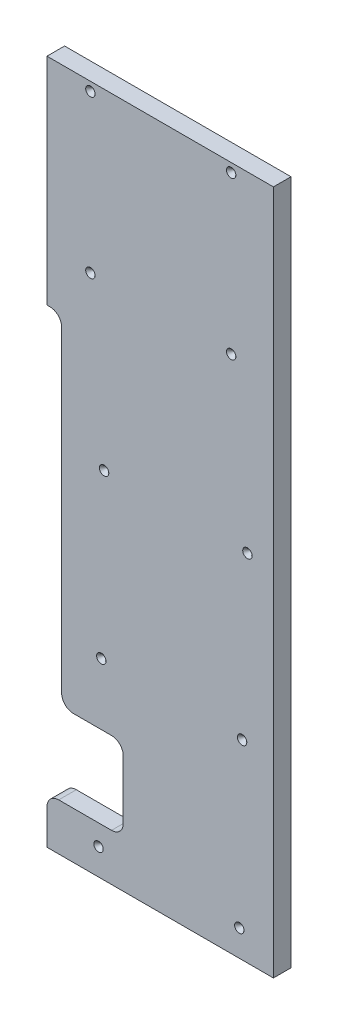
ISO-10303-21;
HEADER;
FILE_DESCRIPTION(('STEP AP214'),'2;1');
FILE_NAME('part.step','',(''),(''),'','','');
FILE_SCHEMA(('AUTOMOTIVE_DESIGN { 1 0 10303 214 1 1 1 1 }'));
ENDSEC;
DATA;
#1=APPLICATION_CONTEXT('core data for automotive mechanical design processes');
#2=APPLICATION_PROTOCOL_DEFINITION('international standard','automotive_design',2000,#1);
#3=PRODUCT_CONTEXT('',#1,'mechanical');
#4=PRODUCT('Part','Part','',(#3));
#5=PRODUCT_RELATED_PRODUCT_CATEGORY('part','',(#4));
#6=PRODUCT_DEFINITION_FORMATION('','',#4);
#7=PRODUCT_DEFINITION_CONTEXT('part definition',#1,'design');
#8=PRODUCT_DEFINITION('design','',#6,#7);
#9=PRODUCT_DEFINITION_SHAPE('','',#8);
#10=(LENGTH_UNIT() NAMED_UNIT(*) SI_UNIT(.MILLI.,.METRE.));
#11=(NAMED_UNIT(*) PLANE_ANGLE_UNIT() SI_UNIT($,.RADIAN.));
#12=(NAMED_UNIT(*) SI_UNIT($,.STERADIAN.) SOLID_ANGLE_UNIT());
#13=UNCERTAINTY_MEASURE_WITH_UNIT(LENGTH_MEASURE(1.E-05),#10,'distance_accuracy_value','');
#14=(GEOMETRIC_REPRESENTATION_CONTEXT(3) GLOBAL_UNCERTAINTY_ASSIGNED_CONTEXT((#13)) GLOBAL_UNIT_ASSIGNED_CONTEXT((#10,
#11,#12)) REPRESENTATION_CONTEXT('',''));
#15=CARTESIAN_POINT('',(0.,0.,0.));
#16=DIRECTION('',(0.,0.,1.));
#17=DIRECTION('',(1.,0.,0.));
#18=AXIS2_PLACEMENT_3D('',#15,#16,#17);
#19=CARTESIAN_POINT('',(80.0100000000102,0.,2.90878432451835E-13));
#20=DIRECTION('',(-1.,0.,0.));
#21=DIRECTION('',(0.,0.,1.));
#22=AXIS2_PLACEMENT_3D('',#19,#20,#21);
#23=PLANE('',#22);
#24=DIRECTION('',(0.,-1.,0.));
#25=VECTOR('',#24,1.);
#26=CARTESIAN_POINT('',(80.0099999999995,5935.9800001442,2740.66));
#27=LINE('',#26,#25);
#28=CARTESIAN_POINT('',(80.0099999999995,5935.9800001442,2740.66));
#29=VERTEX_POINT('',#28);
#30=CARTESIAN_POINT('',(80.0099999999994,5702.6175001442,2740.66));
#31=VERTEX_POINT('',#30);
#32=EDGE_CURVE('E162',#29,#31,#27,.T.);
#33=ORIENTED_EDGE('',*,*,#32,.T.);
#34=DIRECTION('',(0.,0.,1.));
#35=VECTOR('',#34,1.);
#36=CARTESIAN_POINT('',(80.0099999999994,5702.6175001442,2740.659));
#37=LINE('',#36,#35);
#38=CARTESIAN_POINT('',(80.0099999999994,5702.6175001442,2759.71));
#39=VERTEX_POINT('',#38);
#40=EDGE_CURVE('E143',#31,#39,#37,.T.);
#41=ORIENTED_EDGE('',*,*,#40,.T.);
#42=DIRECTION('',(0.,1.,0.));
#43=VECTOR('',#42,1.);
#44=CARTESIAN_POINT('',(80.0099999999995,5194.3,2759.71));
#45=LINE('',#44,#43);
#46=CARTESIAN_POINT('',(80.0099999999994,5935.9800001442,2759.71));
#47=VERTEX_POINT('',#46);
#48=EDGE_CURVE('E175',#39,#47,#45,.T.);
#49=ORIENTED_EDGE('',*,*,#48,.T.);
#50=DIRECTION('',(0.,0.,-1.));
#51=VECTOR('',#50,1.);
#52=CARTESIAN_POINT('',(80.0099999999994,5935.9800001442,2759.71));
#53=LINE('',#52,#51);
#54=EDGE_CURVE('E170',#47,#29,#53,.T.);
#55=ORIENTED_EDGE('',*,*,#54,.T.);
#56=EDGE_LOOP('',(#33,#41,#49,#55));
#57=FACE_BOUND('',#56,.T.);
#58=ADVANCED_FACE('F34',(#57),#23,.T.);
#59=CARTESIAN_POINT('',(205.74,5565.14000007211,2759.71));
#60=DIRECTION('',(0.,0.,-1.));
#61=DIRECTION('',(-1.,0.,0.));
#62=AXIS2_PLACEMENT_3D('',#59,#60,#61);
#63=PLANE('',#62);
#64=CARTESIAN_POINT('',(127.000000000001,5926.4550001442,2759.71000000001));
#65=DIRECTION('',(0.,0.,1.));
#66=DIRECTION('',(1.,0.,0.));
#67=AXIS2_PLACEMENT_3D('',#64,#65,#66);
#68=CIRCLE('',#67,5.08);
#69=CARTESIAN_POINT('',(132.080000000001,5926.4550001442,2759.71000000001));
#70=VERTEX_POINT('',#69);
#71=EDGE_CURVE('E167',#70,#70,#68,.T.);
#72=ORIENTED_EDGE('',*,*,#71,.F.);
#73=EDGE_LOOP('',(#72));
#74=FACE_BOUND('',#73,.T.);
#75=CARTESIAN_POINT('',(279.400000000001,5926.4550001442,2759.71000000001));
#76=DIRECTION('',(0.,0.,1.));
#77=DIRECTION('',(1.,0.,0.));
#78=AXIS2_PLACEMENT_3D('',#75,#76,#77);
#79=CIRCLE('',#78,5.07999999999997);
#80=CARTESIAN_POINT('',(284.480000000001,5926.4550001442,2759.71000000001));
#81=VERTEX_POINT('',#80);
#82=EDGE_CURVE('E252',#81,#81,#79,.T.);
#83=ORIENTED_EDGE('',*,*,#82,.F.);
#84=EDGE_LOOP('',(#83));
#85=FACE_BOUND('',#84,.T.);
#86=CARTESIAN_POINT('',(127.000000000001,5756.275,2759.71000000001));
#87=DIRECTION('',(0.,0.,1.));
#88=DIRECTION('',(1.,0.,0.));
#89=AXIS2_PLACEMENT_3D('',#86,#87,#88);
#90=CIRCLE('',#89,5.08);
#91=CARTESIAN_POINT('',(132.080000000001,5756.275,2759.71000000001));
#92=VERTEX_POINT('',#91);
#93=EDGE_CURVE('E247',#92,#92,#90,.T.);
#94=ORIENTED_EDGE('',*,*,#93,.F.);
#95=EDGE_LOOP('',(#94));
#96=FACE_BOUND('',#95,.T.);
#97=CARTESIAN_POINT('',(279.400000000001,5756.275,2759.71000000001));
#98=DIRECTION('',(0.,0.,1.));
#99=DIRECTION('',(1.,0.,0.));
#100=AXIS2_PLACEMENT_3D('',#97,#98,#99);
#101=CIRCLE('',#100,5.07999999999997);
#102=CARTESIAN_POINT('',(284.480000000001,5756.275,2759.71000000001));
#103=VERTEX_POINT('',#102);
#104=EDGE_CURVE('E242',#103,#103,#101,.T.);
#105=ORIENTED_EDGE('',*,*,#104,.F.);
#106=EDGE_LOOP('',(#105));
#107=FACE_BOUND('',#106,.T.);
#108=CARTESIAN_POINT('',(141.857783583226,5578.47500000002,2759.71000000001));
#109=DIRECTION('',(0.,0.,1.));
#110=DIRECTION('',(1.,0.,0.));
#111=AXIS2_PLACEMENT_3D('',#108,#109,#110);
#112=CIRCLE('',#111,5.08);
#113=CARTESIAN_POINT('',(146.937783583226,5578.47500000002,2759.71000000001));
#114=VERTEX_POINT('',#113);
#115=EDGE_CURVE('E237',#114,#114,#112,.T.);
#116=ORIENTED_EDGE('',*,*,#115,.F.);
#117=EDGE_LOOP('',(#116));
#118=FACE_BOUND('',#117,.T.);
#119=CARTESIAN_POINT('',(296.988891791613,5578.47500000002,2759.71000000001));
#120=DIRECTION('',(0.,0.,1.));
#121=DIRECTION('',(1.,0.,0.));
#122=AXIS2_PLACEMENT_3D('',#119,#120,#121);
#123=CIRCLE('',#122,5.07999999999997);
#124=CARTESIAN_POINT('',(302.068891791613,5578.47500000002,2759.71000000001));
#125=VERTEX_POINT('',#124);
#126=EDGE_CURVE('E232',#125,#125,#123,.T.);
#127=ORIENTED_EDGE('',*,*,#126,.F.);
#128=EDGE_LOOP('',(#127));
#129=FACE_BOUND('',#128,.T.);
#130=CARTESIAN_POINT('',(138.830271302983,5400.675,2759.71000000001));
#131=DIRECTION('',(0.,0.,1.));
#132=DIRECTION('',(1.,0.,0.));
#133=AXIS2_PLACEMENT_3D('',#130,#131,#132);
#134=CIRCLE('',#133,5.08);
#135=CARTESIAN_POINT('',(143.910271302983,5400.675,2759.71000000001));
#136=VERTEX_POINT('',#135);
#137=EDGE_CURVE('E227',#136,#136,#134,.T.);
#138=ORIENTED_EDGE('',*,*,#137,.F.);
#139=EDGE_LOOP('',(#138));
#140=FACE_BOUND('',#139,.T.);
#141=CARTESIAN_POINT('',(291.230271302983,5400.675,2759.71000000001));
#142=DIRECTION('',(0.,0.,1.));
#143=DIRECTION('',(1.,0.,0.));
#144=AXIS2_PLACEMENT_3D('',#141,#142,#143);
#145=CIRCLE('',#144,5.07999999999997);
#146=CARTESIAN_POINT('',(296.310271302983,5400.675,2759.71000000001));
#147=VERTEX_POINT('',#146);
#148=EDGE_CURVE('E222',#147,#147,#145,.T.);
#149=ORIENTED_EDGE('',*,*,#148,.F.);
#150=EDGE_LOOP('',(#149));
#151=FACE_BOUND('',#150,.T.);
#152=CARTESIAN_POINT('',(135.802759022741,5222.875,2759.71000000001));
#153=DIRECTION('',(0.,0.,1.));
#154=DIRECTION('',(1.,0.,0.));
#155=AXIS2_PLACEMENT_3D('',#152,#153,#154);
#156=CIRCLE('',#155,5.08);
#157=CARTESIAN_POINT('',(140.882759022741,5222.875,2759.71000000001));
#158=VERTEX_POINT('',#157);
#159=EDGE_CURVE('E217',#158,#158,#156,.T.);
#160=ORIENTED_EDGE('',*,*,#159,.F.);
#161=EDGE_LOOP('',(#160));
#162=FACE_BOUND('',#161,.T.);
#163=CARTESIAN_POINT('',(288.202759022741,5222.875,2759.71000000001));
#164=DIRECTION('',(0.,0.,1.));
#165=DIRECTION('',(1.,0.,0.));
#166=AXIS2_PLACEMENT_3D('',#163,#164,#165);
#167=CIRCLE('',#166,5.07999999999997);
#168=CARTESIAN_POINT('',(293.282759022741,5222.875,2759.71000000001));
#169=VERTEX_POINT('',#168);
#170=EDGE_CURVE('E212',#169,#169,#167,.T.);
#171=ORIENTED_EDGE('',*,*,#170,.F.);
#172=EDGE_LOOP('',(#171));
#173=FACE_BOUND('',#172,.T.);
#174=DIRECTION('',(0.,-1.,0.));
#175=VECTOR('',#174,1.);
#176=CARTESIAN_POINT('',(95.885,0.,2759.71000000001));
#177=LINE('',#176,#175);
#178=CARTESIAN_POINT('',(95.8849999999995,5689.9175001442,2759.71000000001));
#179=VERTEX_POINT('',#178);
#180=CARTESIAN_POINT('',(95.8849999999995,5346.7,2759.71000000001));
#181=VERTEX_POINT('',#180);
#182=EDGE_CURVE('E314',#179,#181,#177,.T.);
#183=ORIENTED_EDGE('',*,*,#182,.T.);
#184=CARTESIAN_POINT('',(108.585,5346.7,2759.71));
#185=DIRECTION('',(0.,0.,-1.));
#186=DIRECTION('',(-1.,0.,0.));
#187=AXIS2_PLACEMENT_3D('',#184,#185,#186);
#188=CIRCLE('',#187,12.7);
#189=CARTESIAN_POINT('',(108.585,5334.,2759.71000000001));
#190=VERTEX_POINT('',#189);
#191=EDGE_CURVE('E262',#181,#190,#188,.F.);
#192=ORIENTED_EDGE('',*,*,#191,.T.);
#193=DIRECTION('',(1.,0.,0.));
#194=VECTOR('',#193,1.);
#195=CARTESIAN_POINT('',(0.,5334.,2759.71000000001));
#196=LINE('',#195,#194);
#197=CARTESIAN_POINT('',(149.86,5334.,2759.71000000001));
#198=VERTEX_POINT('',#197);
#199=EDGE_CURVE('E154',#190,#198,#196,.T.);
#200=ORIENTED_EDGE('',*,*,#199,.T.);
#201=CARTESIAN_POINT('',(149.86,5321.3,2759.71));
#202=DIRECTION('',(0.,0.,-1.));
#203=DIRECTION('',(-1.,0.,0.));
#204=AXIS2_PLACEMENT_3D('',#201,#202,#203);
#205=CIRCLE('',#204,12.7);
#206=CARTESIAN_POINT('',(162.56,5321.3,2759.71000000001));
#207=VERTEX_POINT('',#206);
#208=EDGE_CURVE('E286',#198,#207,#205,.T.);
#209=ORIENTED_EDGE('',*,*,#208,.T.);
#210=DIRECTION('',(0.,1.,0.));
#211=VECTOR('',#210,1.);
#212=CARTESIAN_POINT('',(162.56,0.,2759.71000000001));
#213=LINE('',#212,#211);
#214=CARTESIAN_POINT('',(162.56,5257.8,2759.71000000001));
#215=VERTEX_POINT('',#214);
#216=EDGE_CURVE('E296',#215,#207,#213,.T.);
#217=ORIENTED_EDGE('',*,*,#216,.F.);
#218=CARTESIAN_POINT('',(149.86,5257.8,2759.71));
#219=DIRECTION('',(0.,0.,-1.));
#220=DIRECTION('',(-1.,0.,0.));
#221=AXIS2_PLACEMENT_3D('',#218,#219,#220);
#222=CIRCLE('',#221,12.7);
#223=CARTESIAN_POINT('',(149.86,5245.1,2759.71000000001));
#224=VERTEX_POINT('',#223);
#225=EDGE_CURVE('E42',#215,#224,#222,.T.);
#226=ORIENTED_EDGE('',*,*,#225,.T.);
#227=DIRECTION('',(1.,0.,0.));
#228=VECTOR('',#227,1.);
#229=CARTESIAN_POINT('',(0.,5245.1,2759.71000000001));
#230=LINE('',#229,#228);
#231=CARTESIAN_POINT('',(92.7099999999995,5245.1,2759.71000000001));
#232=VERTEX_POINT('',#231);
#233=EDGE_CURVE('E295',#232,#224,#230,.T.);
#234=ORIENTED_EDGE('',*,*,#233,.F.);
#235=CARTESIAN_POINT('',(92.7099999999995,5232.4,2759.71));
#236=DIRECTION('',(0.,0.,-1.));
#237=DIRECTION('',(-1.,0.,0.));
#238=AXIS2_PLACEMENT_3D('',#235,#236,#237);
#239=CIRCLE('',#238,12.7);
#240=CARTESIAN_POINT('',(80.0099999999995,5232.4,2759.71));
#241=VERTEX_POINT('',#240);
#242=EDGE_CURVE('E260',#232,#241,#239,.F.);
#243=ORIENTED_EDGE('',*,*,#242,.T.);
#244=CARTESIAN_POINT('',(80.0099999999995,5194.3,2759.71));
#245=VERTEX_POINT('',#244);
#246=EDGE_CURVE('E180',#245,#241,#45,.T.);
#247=ORIENTED_EDGE('',*,*,#246,.F.);
#248=DIRECTION('',(1.,0.,0.));
#249=VECTOR('',#248,1.);
#250=CARTESIAN_POINT('',(325.12,5194.3,2759.71));
#251=LINE('',#250,#249);
#252=CARTESIAN_POINT('',(325.12,5194.3,2759.71));
#253=VERTEX_POINT('',#252);
#254=EDGE_CURVE('E201',#253,#245,#251,.F.);
#255=ORIENTED_EDGE('',*,*,#254,.F.);
#256=DIRECTION('',(0.,1.,0.));
#257=VECTOR('',#256,1.);
#258=CARTESIAN_POINT('',(325.12,5935.9800001442,2759.71));
#259=LINE('',#258,#257);
#260=CARTESIAN_POINT('',(325.12,5935.9800001442,2759.71));
#261=VERTEX_POINT('',#260);
#262=EDGE_CURVE('E182',#261,#253,#259,.F.);
#263=ORIENTED_EDGE('',*,*,#262,.F.);
#264=DIRECTION('',(1.,0.,0.));
#265=VECTOR('',#264,1.);
#266=CARTESIAN_POINT('',(86.3599999999992,5935.9800001442,2759.71));
#267=LINE('',#266,#265);
#268=EDGE_CURVE('E195',#47,#261,#267,.T.);
#269=ORIENTED_EDGE('',*,*,#268,.F.);
#270=ORIENTED_EDGE('',*,*,#48,.F.);
#271=DIRECTION('',(1.,0.,0.));
#272=VECTOR('',#271,1.);
#273=CARTESIAN_POINT('',(0.,5702.6175001442,2759.71000000001));
#274=LINE('',#273,#272);
#275=CARTESIAN_POINT('',(83.1849999999995,5702.6175001442,2759.71000000001));
#276=VERTEX_POINT('',#275);
#277=EDGE_CURVE('E150',#39,#276,#274,.T.);
#278=ORIENTED_EDGE('',*,*,#277,.T.);
#279=CARTESIAN_POINT('',(83.1849999999995,5689.9175001442,2759.71));
#280=DIRECTION('',(0.,0.,-1.));
#281=DIRECTION('',(-1.,0.,0.));
#282=AXIS2_PLACEMENT_3D('',#279,#280,#281);
#283=CIRCLE('',#282,12.7);
#284=EDGE_CURVE('E283',#276,#179,#283,.T.);
#285=ORIENTED_EDGE('',*,*,#284,.T.);
#286=EDGE_LOOP('',(#183,#192,#200,#209,#217,#226,#234,#243,#247,#255,#263,#269,#270,#278,#285));
#287=FACE_BOUND('',#286,.T.);
#288=ADVANCED_FACE('F294',(#74,#85,#96,#107,#118,#129,#140,#151,#162,#173,#287),#63,.F.);
#289=CARTESIAN_POINT('',(325.12,5935.9800001442,2759.71));
#290=DIRECTION('',(1.,0.,0.));
#291=DIRECTION('',(0.,0.,-1.));
#292=AXIS2_PLACEMENT_3D('',#289,#290,#291);
#293=PLANE('',#292);
#294=DIRECTION('',(0.,1.,0.));
#295=VECTOR('',#294,1.);
#296=CARTESIAN_POINT('',(325.12,5565.14000007211,2740.66));
#297=LINE('',#296,#295);
#298=CARTESIAN_POINT('',(325.12,5935.9800001442,2740.66));
#299=VERTEX_POINT('',#298);
#300=CARTESIAN_POINT('',(325.12,5194.3,2740.66));
#301=VERTEX_POINT('',#300);
#302=EDGE_CURVE('E189',#299,#301,#297,.F.);
#303=ORIENTED_EDGE('',*,*,#302,.F.);
#304=DIRECTION('',(0.,0.,1.));
#305=VECTOR('',#304,1.);
#306=CARTESIAN_POINT('',(325.12,5935.9800001442,2759.71));
#307=LINE('',#306,#305);
#308=EDGE_CURVE('E192',#261,#299,#307,.F.);
#309=ORIENTED_EDGE('',*,*,#308,.F.);
#310=ORIENTED_EDGE('',*,*,#262,.T.);
#311=DIRECTION('',(0.,0.,1.));
#312=VECTOR('',#311,1.);
#313=CARTESIAN_POINT('',(325.12,5194.3,2759.71));
#314=LINE('',#313,#312);
#315=EDGE_CURVE('E198',#301,#253,#314,.T.);
#316=ORIENTED_EDGE('',*,*,#315,.F.);
#317=EDGE_LOOP('',(#303,#309,#310,#316));
#318=FACE_BOUND('',#317,.T.);
#319=ADVANCED_FACE('F376',(#318),#293,.T.);
#320=CARTESIAN_POINT('',(325.12,5194.3,2759.71));
#321=DIRECTION('',(0.,-1.,0.));
#322=DIRECTION('',(1.,0.,0.));
#323=AXIS2_PLACEMENT_3D('',#320,#321,#322);
#324=PLANE('',#323);
#325=DIRECTION('',(-1.,0.,0.));
#326=VECTOR('',#325,1.);
#327=CARTESIAN_POINT('',(205.74,5194.3,2740.66));
#328=LINE('',#327,#326);
#329=CARTESIAN_POINT('',(80.0099999999996,5194.3,2740.66));
#330=VERTEX_POINT('',#329);
#331=EDGE_CURVE('E186',#301,#330,#328,.T.);
#332=ORIENTED_EDGE('',*,*,#331,.F.);
#333=ORIENTED_EDGE('',*,*,#315,.T.);
#334=ORIENTED_EDGE('',*,*,#254,.T.);
#335=DIRECTION('',(0.,0.,1.));
#336=VECTOR('',#335,1.);
#337=CARTESIAN_POINT('',(80.0099999999996,5194.3,2740.66));
#338=LINE('',#337,#336);
#339=EDGE_CURVE('E171',#330,#245,#338,.T.);
#340=ORIENTED_EDGE('',*,*,#339,.F.);
#341=EDGE_LOOP('',(#332,#333,#334,#340));
#342=FACE_BOUND('',#341,.T.);
#343=ADVANCED_FACE('F385',(#342),#324,.T.);
#344=CARTESIAN_POINT('',(86.3599999999992,5935.9800001442,2759.71));
#345=DIRECTION('',(0.,1.,0.));
#346=DIRECTION('',(0.,0.,1.));
#347=AXIS2_PLACEMENT_3D('',#344,#345,#346);
#348=PLANE('',#347);
#349=DIRECTION('',(-1.,0.,0.));
#350=VECTOR('',#349,1.);
#351=CARTESIAN_POINT('',(205.74,5935.9800001442,2740.66));
#352=LINE('',#351,#350);
#353=EDGE_CURVE('E183',#29,#299,#352,.F.);
#354=ORIENTED_EDGE('',*,*,#353,.F.);
#355=ORIENTED_EDGE('',*,*,#54,.F.);
#356=ORIENTED_EDGE('',*,*,#268,.T.);
#357=ORIENTED_EDGE('',*,*,#308,.T.);
#358=EDGE_LOOP('',(#354,#355,#356,#357));
#359=FACE_BOUND('',#358,.T.);
#360=ADVANCED_FACE('F399',(#359),#348,.T.);
#361=CARTESIAN_POINT('',(205.74,5565.14000007211,2740.66));
#362=DIRECTION('',(0.,0.,-1.));
#363=DIRECTION('',(-1.,0.,0.));
#364=AXIS2_PLACEMENT_3D('',#361,#362,#363);
#365=PLANE('',#364);
#366=DIRECTION('',(1.,0.,0.));
#367=VECTOR('',#366,1.);
#368=CARTESIAN_POINT('',(0.,5334.,2740.66));
#369=LINE('',#368,#367);
#370=CARTESIAN_POINT('',(108.585,5334.,2740.66));
#371=VERTEX_POINT('',#370);
#372=CARTESIAN_POINT('',(149.86,5334.,2740.66));
#373=VERTEX_POINT('',#372);
#374=EDGE_CURVE('E312',#371,#373,#369,.T.);
#375=ORIENTED_EDGE('',*,*,#374,.F.);
#376=CARTESIAN_POINT('',(108.585,5346.7,2740.66));
#377=DIRECTION('',(0.,0.,-1.));
#378=DIRECTION('',(-1.,0.,0.));
#379=AXIS2_PLACEMENT_3D('',#376,#377,#378);
#380=CIRCLE('',#379,12.7);
#381=CARTESIAN_POINT('',(95.8849999999995,5346.7,2740.66));
#382=VERTEX_POINT('',#381);
#383=EDGE_CURVE('E271',#371,#382,#380,.T.);
#384=ORIENTED_EDGE('',*,*,#383,.T.);
#385=DIRECTION('',(0.,-1.,0.));
#386=VECTOR('',#385,1.);
#387=CARTESIAN_POINT('',(95.885,0.,2740.66));
#388=LINE('',#387,#386);
#389=CARTESIAN_POINT('',(95.8849999999995,5689.9175001442,2740.66));
#390=VERTEX_POINT('',#389);
#391=EDGE_CURVE('E317',#390,#382,#388,.T.);
#392=ORIENTED_EDGE('',*,*,#391,.F.);
#393=CARTESIAN_POINT('',(83.1849999999995,5689.9175001442,2740.66));
#394=DIRECTION('',(0.,0.,-1.));
#395=DIRECTION('',(-1.,0.,0.));
#396=AXIS2_PLACEMENT_3D('',#393,#394,#395);
#397=CIRCLE('',#396,12.7);
#398=CARTESIAN_POINT('',(83.1849999999995,5702.6175001442,2740.66));
#399=VERTEX_POINT('',#398);
#400=EDGE_CURVE('E166',#390,#399,#397,.F.);
#401=ORIENTED_EDGE('',*,*,#400,.T.);
#402=DIRECTION('',(1.,0.,0.));
#403=VECTOR('',#402,1.);
#404=CARTESIAN_POINT('',(0.,5702.6175001442,2740.66));
#405=LINE('',#404,#403);
#406=EDGE_CURVE('E147',#31,#399,#405,.T.);
#407=ORIENTED_EDGE('',*,*,#406,.F.);
#408=ORIENTED_EDGE('',*,*,#32,.F.);
#409=ORIENTED_EDGE('',*,*,#353,.T.);
#410=ORIENTED_EDGE('',*,*,#302,.T.);
#411=ORIENTED_EDGE('',*,*,#331,.T.);
#412=CARTESIAN_POINT('',(80.0099999999996,5232.4,2740.66));
#413=VERTEX_POINT('',#412);
#414=EDGE_CURVE('E172',#413,#330,#27,.T.);
#415=ORIENTED_EDGE('',*,*,#414,.F.);
#416=CARTESIAN_POINT('',(92.7099999999996,5232.4,2740.66));
#417=DIRECTION('',(0.,0.,-1.));
#418=DIRECTION('',(-1.,0.,0.));
#419=AXIS2_PLACEMENT_3D('',#416,#417,#418);
#420=CIRCLE('',#419,12.7);
#421=CARTESIAN_POINT('',(92.7099999999996,5245.1,2740.66));
#422=VERTEX_POINT('',#421);
#423=EDGE_CURVE('E269',#413,#422,#420,.T.);
#424=ORIENTED_EDGE('',*,*,#423,.T.);
#425=DIRECTION('',(1.,0.,0.));
#426=VECTOR('',#425,1.);
#427=CARTESIAN_POINT('',(0.,5245.1,2740.66));
#428=LINE('',#427,#426);
#429=CARTESIAN_POINT('',(149.86,5245.1,2740.66));
#430=VERTEX_POINT('',#429);
#431=EDGE_CURVE('E310',#422,#430,#428,.T.);
#432=ORIENTED_EDGE('',*,*,#431,.T.);
#433=CARTESIAN_POINT('',(149.86,5257.8,2740.66));
#434=DIRECTION('',(0.,0.,-1.));
#435=DIRECTION('',(-1.,0.,0.));
#436=AXIS2_PLACEMENT_3D('',#433,#434,#435);
#437=CIRCLE('',#436,12.7);
#438=CARTESIAN_POINT('',(162.56,5257.8,2740.66));
#439=VERTEX_POINT('',#438);
#440=EDGE_CURVE('E11',#430,#439,#437,.F.);
#441=ORIENTED_EDGE('',*,*,#440,.T.);
#442=DIRECTION('',(0.,1.,0.));
#443=VECTOR('',#442,1.);
#444=CARTESIAN_POINT('',(162.56,0.,2740.66));
#445=LINE('',#444,#443);
#446=CARTESIAN_POINT('',(162.56,5321.3,2740.66));
#447=VERTEX_POINT('',#446);
#448=EDGE_CURVE('E308',#439,#447,#445,.T.);
#449=ORIENTED_EDGE('',*,*,#448,.T.);
#450=CARTESIAN_POINT('',(149.86,5321.3,2740.66));
#451=DIRECTION('',(0.,0.,-1.));
#452=DIRECTION('',(-1.,0.,0.));
#453=AXIS2_PLACEMENT_3D('',#450,#451,#452);
#454=CIRCLE('',#453,12.7);
#455=EDGE_CURVE('E288',#447,#373,#454,.F.);
#456=ORIENTED_EDGE('',*,*,#455,.T.);
#457=EDGE_LOOP('',(#375,#384,#392,#401,#407,#408,#409,#410,#411,#415,#424,#432,#441,#449,#456));
#458=FACE_BOUND('',#457,.T.);
#459=CARTESIAN_POINT('',(127.000000000001,5926.4550001442,2740.66));
#460=DIRECTION('',(0.,0.,-1.));
#461=DIRECTION('',(-1.,0.,0.));
#462=AXIS2_PLACEMENT_3D('',#459,#460,#461);
#463=CIRCLE('',#462,0.991870000000006);
#464=CARTESIAN_POINT('',(126.008130000001,5926.4550001442,2740.66));
#465=VERTEX_POINT('',#464);
#466=EDGE_CURVE('E249',#465,#465,#463,.T.);
#467=ORIENTED_EDGE('',*,*,#466,.F.);
#468=EDGE_LOOP('',(#467));
#469=FACE_BOUND('',#468,.T.);
#470=CARTESIAN_POINT('',(279.400000000001,5926.4550001442,2740.66));
#471=DIRECTION('',(0.,0.,-1.));
#472=DIRECTION('',(-1.,0.,0.));
#473=AXIS2_PLACEMENT_3D('',#470,#471,#472);
#474=CIRCLE('',#473,0.991870000000006);
#475=CARTESIAN_POINT('',(278.408130000001,5926.4550001442,2740.66));
#476=VERTEX_POINT('',#475);
#477=EDGE_CURVE('E244',#476,#476,#474,.T.);
#478=ORIENTED_EDGE('',*,*,#477,.F.);
#479=EDGE_LOOP('',(#478));
#480=FACE_BOUND('',#479,.T.);
#481=CARTESIAN_POINT('',(127.000000000001,5756.275,2740.66));
#482=DIRECTION('',(0.,0.,-1.));
#483=DIRECTION('',(-1.,0.,0.));
#484=AXIS2_PLACEMENT_3D('',#481,#482,#483);
#485=CIRCLE('',#484,0.991870000000006);
#486=CARTESIAN_POINT('',(126.008130000001,5756.275,2740.66));
#487=VERTEX_POINT('',#486);
#488=EDGE_CURVE('E239',#487,#487,#485,.T.);
#489=ORIENTED_EDGE('',*,*,#488,.F.);
#490=EDGE_LOOP('',(#489));
#491=FACE_BOUND('',#490,.T.);
#492=CARTESIAN_POINT('',(279.400000000001,5756.275,2740.66));
#493=DIRECTION('',(0.,0.,-1.));
#494=DIRECTION('',(-1.,0.,0.));
#495=AXIS2_PLACEMENT_3D('',#492,#493,#494);
#496=CIRCLE('',#495,0.991870000000006);
#497=CARTESIAN_POINT('',(278.408130000001,5756.275,2740.66));
#498=VERTEX_POINT('',#497);
#499=EDGE_CURVE('E234',#498,#498,#496,.T.);
#500=ORIENTED_EDGE('',*,*,#499,.F.);
#501=EDGE_LOOP('',(#500));
#502=FACE_BOUND('',#501,.T.);
#503=CARTESIAN_POINT('',(141.857783583226,5578.47500000002,2740.66));
#504=DIRECTION('',(0.,0.,-1.));
#505=DIRECTION('',(-1.,0.,0.));
#506=AXIS2_PLACEMENT_3D('',#503,#504,#505);
#507=CIRCLE('',#506,0.991870000000006);
#508=CARTESIAN_POINT('',(140.865913583226,5578.47500000002,2740.66));
#509=VERTEX_POINT('',#508);
#510=EDGE_CURVE('E229',#509,#509,#507,.T.);
#511=ORIENTED_EDGE('',*,*,#510,.F.);
#512=EDGE_LOOP('',(#511));
#513=FACE_BOUND('',#512,.T.);
#514=CARTESIAN_POINT('',(296.988891791613,5578.47500000002,2740.66));
#515=DIRECTION('',(0.,0.,-1.));
#516=DIRECTION('',(-1.,0.,0.));
#517=AXIS2_PLACEMENT_3D('',#514,#515,#516);
#518=CIRCLE('',#517,0.991870000000006);
#519=CARTESIAN_POINT('',(295.997021791613,5578.47500000002,2740.66));
#520=VERTEX_POINT('',#519);
#521=EDGE_CURVE('E224',#520,#520,#518,.T.);
#522=ORIENTED_EDGE('',*,*,#521,.F.);
#523=EDGE_LOOP('',(#522));
#524=FACE_BOUND('',#523,.T.);
#525=CARTESIAN_POINT('',(138.830271302983,5400.675,2740.66));
#526=DIRECTION('',(0.,0.,-1.));
#527=DIRECTION('',(-1.,0.,0.));
#528=AXIS2_PLACEMENT_3D('',#525,#526,#527);
#529=CIRCLE('',#528,0.991870000000006);
#530=CARTESIAN_POINT('',(137.838401302983,5400.675,2740.66));
#531=VERTEX_POINT('',#530);
#532=EDGE_CURVE('E219',#531,#531,#529,.T.);
#533=ORIENTED_EDGE('',*,*,#532,.F.);
#534=EDGE_LOOP('',(#533));
#535=FACE_BOUND('',#534,.T.);
#536=CARTESIAN_POINT('',(291.230271302983,5400.675,2740.66));
#537=DIRECTION('',(0.,0.,-1.));
#538=DIRECTION('',(-1.,0.,0.));
#539=AXIS2_PLACEMENT_3D('',#536,#537,#538);
#540=CIRCLE('',#539,0.991870000000006);
#541=CARTESIAN_POINT('',(290.238401302983,5400.675,2740.66));
#542=VERTEX_POINT('',#541);
#543=EDGE_CURVE('E214',#542,#542,#540,.T.);
#544=ORIENTED_EDGE('',*,*,#543,.F.);
#545=EDGE_LOOP('',(#544));
#546=FACE_BOUND('',#545,.T.);
#547=CARTESIAN_POINT('',(135.802759022741,5222.875,2740.66));
#548=DIRECTION('',(0.,0.,-1.));
#549=DIRECTION('',(-1.,0.,0.));
#550=AXIS2_PLACEMENT_3D('',#547,#548,#549);
#551=CIRCLE('',#550,0.991870000000006);
#552=CARTESIAN_POINT('',(134.810889022741,5222.875,2740.66));
#553=VERTEX_POINT('',#552);
#554=EDGE_CURVE('E209',#553,#553,#551,.T.);
#555=ORIENTED_EDGE('',*,*,#554,.F.);
#556=EDGE_LOOP('',(#555));
#557=FACE_BOUND('',#556,.T.);
#558=CARTESIAN_POINT('',(288.202759022741,5222.875,2740.66));
#559=DIRECTION('',(0.,0.,-1.));
#560=DIRECTION('',(-1.,0.,0.));
#561=AXIS2_PLACEMENT_3D('',#558,#559,#560);
#562=CIRCLE('',#561,0.991870000000006);
#563=CARTESIAN_POINT('',(287.210889022741,5222.875,2740.66));
#564=VERTEX_POINT('',#563);
#565=EDGE_CURVE('E205',#564,#564,#562,.T.);
#566=ORIENTED_EDGE('',*,*,#565,.F.);
#567=EDGE_LOOP('',(#566));
#568=FACE_BOUND('',#567,.T.);
#569=ADVANCED_FACE('F159',(#458,#469,#480,#491,#502,#513,#524,#535,#546,#557,#568),#365,.T.);
#570=ORIENTED_EDGE('',*,*,#246,.T.);
#571=DIRECTION('',(0.,0.,1.));
#572=VECTOR('',#571,1.);
#573=CARTESIAN_POINT('',(80.0099999999996,5232.4,2740.66));
#574=LINE('',#573,#572);
#575=EDGE_CURVE('E49',#241,#413,#574,.F.);
#576=ORIENTED_EDGE('',*,*,#575,.T.);
#577=ORIENTED_EDGE('',*,*,#414,.T.);
#578=ORIENTED_EDGE('',*,*,#339,.T.);
#579=EDGE_LOOP('',(#570,#576,#577,#578));
#580=FACE_BOUND('',#579,.T.);
#581=ADVANCED_FACE('F379',(#580),#23,.T.);
#582=CARTESIAN_POINT('',(288.202759022741,5222.875,2759.71000000001));
#583=DIRECTION('',(0.,0.,1.));
#584=DIRECTION('',(1.,0.,0.));
#585=AXIS2_PLACEMENT_3D('',#582,#583,#584);
#586=CYLINDRICAL_SURFACE('',#585,0.991870000000006);
#587=ORIENTED_EDGE('',*,*,#565,.T.);
#588=EDGE_LOOP('',(#587));
#589=FACE_BOUND('',#588,.T.);
#590=CARTESIAN_POINT('',(288.202759022741,5222.875,2755.00714440339));
#591=DIRECTION('',(0.,0.,1.));
#592=DIRECTION('',(1.,0.,0.));
#593=AXIS2_PLACEMENT_3D('',#590,#591,#592);
#594=CIRCLE('',#593,0.991870000000006);
#595=CARTESIAN_POINT('',(289.194629022741,5222.875,2755.00714440339));
#596=VERTEX_POINT('',#595);
#597=EDGE_CURVE('E208',#596,#596,#594,.T.);
#598=ORIENTED_EDGE('',*,*,#597,.T.);
#599=EDGE_LOOP('',(#598));
#600=FACE_BOUND('',#599,.T.);
#601=ADVANCED_FACE('F366',(#589,#600),#586,.F.);
#602=CARTESIAN_POINT('',(288.202759022741,5222.875,2759.71000000001));
#603=DIRECTION('',(0.,0.,1.));
#604=DIRECTION('',(1.,0.,0.));
#605=AXIS2_PLACEMENT_3D('',#602,#603,#604);
#606=CONICAL_SURFACE('',#605,5.07999999999997,0.715584993317694);
#607=ORIENTED_EDGE('',*,*,#597,.F.);
#608=EDGE_LOOP('',(#607));
#609=FACE_BOUND('',#608,.T.);
#610=ORIENTED_EDGE('',*,*,#170,.T.);
#611=EDGE_LOOP('',(#610));
#612=FACE_BOUND('',#611,.T.);
#613=ADVANCED_FACE('F368',(#609,#612),#606,.F.);
#614=CARTESIAN_POINT('',(135.802759022741,5222.875,2759.71000000001));
#615=DIRECTION('',(0.,0.,1.));
#616=DIRECTION('',(1.,0.,0.));
#617=AXIS2_PLACEMENT_3D('',#614,#615,#616);
#618=CYLINDRICAL_SURFACE('',#617,0.991870000000006);
#619=ORIENTED_EDGE('',*,*,#554,.T.);
#620=EDGE_LOOP('',(#619));
#621=FACE_BOUND('',#620,.T.);
#622=CARTESIAN_POINT('',(135.802759022741,5222.875,2755.00714440339));
#623=DIRECTION('',(0.,0.,1.));
#624=DIRECTION('',(1.,0.,0.));
#625=AXIS2_PLACEMENT_3D('',#622,#623,#624);
#626=CIRCLE('',#625,0.991870000000006);
#627=CARTESIAN_POINT('',(136.794629022741,5222.875,2755.00714440339));
#628=VERTEX_POINT('',#627);
#629=EDGE_CURVE('E213',#628,#628,#626,.T.);
#630=ORIENTED_EDGE('',*,*,#629,.T.);
#631=EDGE_LOOP('',(#630));
#632=FACE_BOUND('',#631,.T.);
#633=ADVANCED_FACE('F371',(#621,#632),#618,.F.);
#634=CARTESIAN_POINT('',(135.802759022741,5222.875,2759.71000000001));
#635=DIRECTION('',(0.,0.,1.));
#636=DIRECTION('',(1.,0.,0.));
#637=AXIS2_PLACEMENT_3D('',#634,#635,#636);
#638=CONICAL_SURFACE('',#637,5.08,0.715584993317697);
#639=ORIENTED_EDGE('',*,*,#629,.F.);
#640=EDGE_LOOP('',(#639));
#641=FACE_BOUND('',#640,.T.);
#642=ORIENTED_EDGE('',*,*,#159,.T.);
#643=EDGE_LOOP('',(#642));
#644=FACE_BOUND('',#643,.T.);
#645=ADVANCED_FACE('F523',(#641,#644),#638,.F.);
#646=CARTESIAN_POINT('',(291.230271302983,5400.675,2759.71000000001));
#647=DIRECTION('',(0.,0.,1.));
#648=DIRECTION('',(1.,0.,0.));
#649=AXIS2_PLACEMENT_3D('',#646,#647,#648);
#650=CYLINDRICAL_SURFACE('',#649,0.991870000000006);
#651=ORIENTED_EDGE('',*,*,#543,.T.);
#652=EDGE_LOOP('',(#651));
#653=FACE_BOUND('',#652,.T.);
#654=CARTESIAN_POINT('',(291.230271302983,5400.675,2755.00714440339));
#655=DIRECTION('',(0.,0.,1.));
#656=DIRECTION('',(1.,0.,0.));
#657=AXIS2_PLACEMENT_3D('',#654,#655,#656);
#658=CIRCLE('',#657,0.991870000000006);
#659=CARTESIAN_POINT('',(292.222141302983,5400.675,2755.00714440339));
#660=VERTEX_POINT('',#659);
#661=EDGE_CURVE('E218',#660,#660,#658,.T.);
#662=ORIENTED_EDGE('',*,*,#661,.T.);
#663=EDGE_LOOP('',(#662));
#664=FACE_BOUND('',#663,.T.);
#665=ADVANCED_FACE('F519',(#653,#664),#650,.F.);
#666=CARTESIAN_POINT('',(291.230271302983,5400.675,2759.71000000001));
#667=DIRECTION('',(0.,0.,1.));
#668=DIRECTION('',(1.,0.,0.));
#669=AXIS2_PLACEMENT_3D('',#666,#667,#668);
#670=CONICAL_SURFACE('',#669,5.07999999999997,0.715584993317694);
#671=ORIENTED_EDGE('',*,*,#661,.F.);
#672=EDGE_LOOP('',(#671));
#673=FACE_BOUND('',#672,.T.);
#674=ORIENTED_EDGE('',*,*,#148,.T.);
#675=EDGE_LOOP('',(#674));
#676=FACE_BOUND('',#675,.T.);
#677=ADVANCED_FACE('F515',(#673,#676),#670,.F.);
#678=CARTESIAN_POINT('',(138.830271302983,5400.675,2759.71000000001));
#679=DIRECTION('',(0.,0.,1.));
#680=DIRECTION('',(1.,0.,0.));
#681=AXIS2_PLACEMENT_3D('',#678,#679,#680);
#682=CYLINDRICAL_SURFACE('',#681,0.991870000000006);
#683=ORIENTED_EDGE('',*,*,#532,.T.);
#684=EDGE_LOOP('',(#683));
#685=FACE_BOUND('',#684,.T.);
#686=CARTESIAN_POINT('',(138.830271302983,5400.675,2755.00714440339));
#687=DIRECTION('',(0.,0.,1.));
#688=DIRECTION('',(1.,0.,0.));
#689=AXIS2_PLACEMENT_3D('',#686,#687,#688);
#690=CIRCLE('',#689,0.991870000000006);
#691=CARTESIAN_POINT('',(139.822141302983,5400.675,2755.00714440339));
#692=VERTEX_POINT('',#691);
#693=EDGE_CURVE('E223',#692,#692,#690,.T.);
#694=ORIENTED_EDGE('',*,*,#693,.T.);
#695=EDGE_LOOP('',(#694));
#696=FACE_BOUND('',#695,.T.);
#697=ADVANCED_FACE('F511',(#685,#696),#682,.F.);
#698=CARTESIAN_POINT('',(138.830271302983,5400.675,2759.71000000001));
#699=DIRECTION('',(0.,0.,1.));
#700=DIRECTION('',(1.,0.,0.));
#701=AXIS2_PLACEMENT_3D('',#698,#699,#700);
#702=CONICAL_SURFACE('',#701,5.08,0.715584993317697);
#703=ORIENTED_EDGE('',*,*,#693,.F.);
#704=EDGE_LOOP('',(#703));
#705=FACE_BOUND('',#704,.T.);
#706=ORIENTED_EDGE('',*,*,#137,.T.);
#707=EDGE_LOOP('',(#706));
#708=FACE_BOUND('',#707,.T.);
#709=ADVANCED_FACE('F507',(#705,#708),#702,.F.);
#710=CARTESIAN_POINT('',(296.988891791613,5578.47500000002,2759.71000000001));
#711=DIRECTION('',(0.,0.,1.));
#712=DIRECTION('',(1.,0.,0.));
#713=AXIS2_PLACEMENT_3D('',#710,#711,#712);
#714=CYLINDRICAL_SURFACE('',#713,0.991870000000006);
#715=ORIENTED_EDGE('',*,*,#521,.T.);
#716=EDGE_LOOP('',(#715));
#717=FACE_BOUND('',#716,.T.);
#718=CARTESIAN_POINT('',(296.988891791613,5578.47500000002,2755.00714440339));
#719=DIRECTION('',(0.,0.,1.));
#720=DIRECTION('',(1.,0.,0.));
#721=AXIS2_PLACEMENT_3D('',#718,#719,#720);
#722=CIRCLE('',#721,0.991870000000006);
#723=CARTESIAN_POINT('',(297.980761791613,5578.47500000002,2755.00714440339));
#724=VERTEX_POINT('',#723);
#725=EDGE_CURVE('E228',#724,#724,#722,.T.);
#726=ORIENTED_EDGE('',*,*,#725,.T.);
#727=EDGE_LOOP('',(#726));
#728=FACE_BOUND('',#727,.T.);
#729=ADVANCED_FACE('F503',(#717,#728),#714,.F.);
#730=CARTESIAN_POINT('',(296.988891791613,5578.47500000002,2759.71000000001));
#731=DIRECTION('',(0.,0.,1.));
#732=DIRECTION('',(1.,0.,0.));
#733=AXIS2_PLACEMENT_3D('',#730,#731,#732);
#734=CONICAL_SURFACE('',#733,5.07999999999997,0.715584993317694);
#735=ORIENTED_EDGE('',*,*,#725,.F.);
#736=EDGE_LOOP('',(#735));
#737=FACE_BOUND('',#736,.T.);
#738=ORIENTED_EDGE('',*,*,#126,.T.);
#739=EDGE_LOOP('',(#738));
#740=FACE_BOUND('',#739,.T.);
#741=ADVANCED_FACE('F499',(#737,#740),#734,.F.);
#742=CARTESIAN_POINT('',(141.857783583226,5578.47500000002,2759.71000000001));
#743=DIRECTION('',(0.,0.,1.));
#744=DIRECTION('',(1.,0.,0.));
#745=AXIS2_PLACEMENT_3D('',#742,#743,#744);
#746=CYLINDRICAL_SURFACE('',#745,0.991870000000006);
#747=ORIENTED_EDGE('',*,*,#510,.T.);
#748=EDGE_LOOP('',(#747));
#749=FACE_BOUND('',#748,.T.);
#750=CARTESIAN_POINT('',(141.857783583226,5578.47500000002,2755.00714440339));
#751=DIRECTION('',(0.,0.,1.));
#752=DIRECTION('',(1.,0.,0.));
#753=AXIS2_PLACEMENT_3D('',#750,#751,#752);
#754=CIRCLE('',#753,0.991870000000006);
#755=CARTESIAN_POINT('',(142.849653583226,5578.47500000002,2755.00714440339));
#756=VERTEX_POINT('',#755);
#757=EDGE_CURVE('E233',#756,#756,#754,.T.);
#758=ORIENTED_EDGE('',*,*,#757,.T.);
#759=EDGE_LOOP('',(#758));
#760=FACE_BOUND('',#759,.T.);
#761=ADVANCED_FACE('F495',(#749,#760),#746,.F.);
#762=CARTESIAN_POINT('',(141.857783583226,5578.47500000002,2759.71000000001));
#763=DIRECTION('',(0.,0.,1.));
#764=DIRECTION('',(1.,0.,0.));
#765=AXIS2_PLACEMENT_3D('',#762,#763,#764);
#766=CONICAL_SURFACE('',#765,5.08,0.715584993317697);
#767=ORIENTED_EDGE('',*,*,#757,.F.);
#768=EDGE_LOOP('',(#767));
#769=FACE_BOUND('',#768,.T.);
#770=ORIENTED_EDGE('',*,*,#115,.T.);
#771=EDGE_LOOP('',(#770));
#772=FACE_BOUND('',#771,.T.);
#773=ADVANCED_FACE('F491',(#769,#772),#766,.F.);
#774=CARTESIAN_POINT('',(279.400000000001,5756.275,2759.71000000001));
#775=DIRECTION('',(0.,0.,1.));
#776=DIRECTION('',(1.,0.,0.));
#777=AXIS2_PLACEMENT_3D('',#774,#775,#776);
#778=CYLINDRICAL_SURFACE('',#777,0.991870000000006);
#779=ORIENTED_EDGE('',*,*,#499,.T.);
#780=EDGE_LOOP('',(#779));
#781=FACE_BOUND('',#780,.T.);
#782=CARTESIAN_POINT('',(279.400000000001,5756.275,2755.00714440339));
#783=DIRECTION('',(0.,0.,1.));
#784=DIRECTION('',(1.,0.,0.));
#785=AXIS2_PLACEMENT_3D('',#782,#783,#784);
#786=CIRCLE('',#785,0.991870000000006);
#787=CARTESIAN_POINT('',(280.391870000001,5756.275,2755.00714440339));
#788=VERTEX_POINT('',#787);
#789=EDGE_CURVE('E238',#788,#788,#786,.T.);
#790=ORIENTED_EDGE('',*,*,#789,.T.);
#791=EDGE_LOOP('',(#790));
#792=FACE_BOUND('',#791,.T.);
#793=ADVANCED_FACE('F487',(#781,#792),#778,.F.);
#794=CARTESIAN_POINT('',(279.400000000001,5756.275,2759.71000000001));
#795=DIRECTION('',(0.,0.,1.));
#796=DIRECTION('',(1.,0.,0.));
#797=AXIS2_PLACEMENT_3D('',#794,#795,#796);
#798=CONICAL_SURFACE('',#797,5.07999999999997,0.715584993317694);
#799=ORIENTED_EDGE('',*,*,#789,.F.);
#800=EDGE_LOOP('',(#799));
#801=FACE_BOUND('',#800,.T.);
#802=ORIENTED_EDGE('',*,*,#104,.T.);
#803=EDGE_LOOP('',(#802));
#804=FACE_BOUND('',#803,.T.);
#805=ADVANCED_FACE('F483',(#801,#804),#798,.F.);
#806=CARTESIAN_POINT('',(127.000000000001,5756.275,2759.71000000001));
#807=DIRECTION('',(0.,0.,1.));
#808=DIRECTION('',(1.,0.,0.));
#809=AXIS2_PLACEMENT_3D('',#806,#807,#808);
#810=CYLINDRICAL_SURFACE('',#809,0.991870000000006);
#811=ORIENTED_EDGE('',*,*,#488,.T.);
#812=EDGE_LOOP('',(#811));
#813=FACE_BOUND('',#812,.T.);
#814=CARTESIAN_POINT('',(127.000000000001,5756.275,2755.00714440339));
#815=DIRECTION('',(0.,0.,1.));
#816=DIRECTION('',(1.,0.,0.));
#817=AXIS2_PLACEMENT_3D('',#814,#815,#816);
#818=CIRCLE('',#817,0.991870000000006);
#819=CARTESIAN_POINT('',(127.991870000001,5756.275,2755.00714440339));
#820=VERTEX_POINT('',#819);
#821=EDGE_CURVE('E243',#820,#820,#818,.T.);
#822=ORIENTED_EDGE('',*,*,#821,.T.);
#823=EDGE_LOOP('',(#822));
#824=FACE_BOUND('',#823,.T.);
#825=ADVANCED_FACE('F479',(#813,#824),#810,.F.);
#826=CARTESIAN_POINT('',(127.000000000001,5756.275,2759.71000000001));
#827=DIRECTION('',(0.,0.,1.));
#828=DIRECTION('',(1.,0.,0.));
#829=AXIS2_PLACEMENT_3D('',#826,#827,#828);
#830=CONICAL_SURFACE('',#829,5.08,0.715584993317697);
#831=ORIENTED_EDGE('',*,*,#821,.F.);
#832=EDGE_LOOP('',(#831));
#833=FACE_BOUND('',#832,.T.);
#834=ORIENTED_EDGE('',*,*,#93,.T.);
#835=EDGE_LOOP('',(#834));
#836=FACE_BOUND('',#835,.T.);
#837=ADVANCED_FACE('F475',(#833,#836),#830,.F.);
#838=CARTESIAN_POINT('',(279.400000000001,5926.4550001442,2759.71000000001));
#839=DIRECTION('',(0.,0.,1.));
#840=DIRECTION('',(1.,0.,0.));
#841=AXIS2_PLACEMENT_3D('',#838,#839,#840);
#842=CYLINDRICAL_SURFACE('',#841,0.991870000000006);
#843=ORIENTED_EDGE('',*,*,#477,.T.);
#844=EDGE_LOOP('',(#843));
#845=FACE_BOUND('',#844,.T.);
#846=CARTESIAN_POINT('',(279.400000000001,5926.4550001442,2755.00714440339));
#847=DIRECTION('',(0.,0.,1.));
#848=DIRECTION('',(1.,0.,0.));
#849=AXIS2_PLACEMENT_3D('',#846,#847,#848);
#850=CIRCLE('',#849,0.991870000000006);
#851=CARTESIAN_POINT('',(280.391870000001,5926.4550001442,2755.00714440339));
#852=VERTEX_POINT('',#851);
#853=EDGE_CURVE('E248',#852,#852,#850,.T.);
#854=ORIENTED_EDGE('',*,*,#853,.T.);
#855=EDGE_LOOP('',(#854));
#856=FACE_BOUND('',#855,.T.);
#857=ADVANCED_FACE('F471',(#845,#856),#842,.F.);
#858=CARTESIAN_POINT('',(279.400000000001,5926.4550001442,2759.71000000001));
#859=DIRECTION('',(0.,0.,1.));
#860=DIRECTION('',(1.,0.,0.));
#861=AXIS2_PLACEMENT_3D('',#858,#859,#860);
#862=CONICAL_SURFACE('',#861,5.07999999999997,0.715584993317694);
#863=ORIENTED_EDGE('',*,*,#853,.F.);
#864=EDGE_LOOP('',(#863));
#865=FACE_BOUND('',#864,.T.);
#866=ORIENTED_EDGE('',*,*,#82,.T.);
#867=EDGE_LOOP('',(#866));
#868=FACE_BOUND('',#867,.T.);
#869=ADVANCED_FACE('F467',(#865,#868),#862,.F.);
#870=CARTESIAN_POINT('',(127.000000000001,5926.4550001442,2759.71000000001));
#871=DIRECTION('',(0.,0.,1.));
#872=DIRECTION('',(1.,0.,0.));
#873=AXIS2_PLACEMENT_3D('',#870,#871,#872);
#874=CYLINDRICAL_SURFACE('',#873,0.991870000000006);
#875=ORIENTED_EDGE('',*,*,#466,.T.);
#876=EDGE_LOOP('',(#875));
#877=FACE_BOUND('',#876,.T.);
#878=CARTESIAN_POINT('',(127.000000000001,5926.4550001442,2755.00714440339));
#879=DIRECTION('',(0.,0.,1.));
#880=DIRECTION('',(1.,0.,0.));
#881=AXIS2_PLACEMENT_3D('',#878,#879,#880);
#882=CIRCLE('',#881,0.991870000000006);
#883=CARTESIAN_POINT('',(127.991870000001,5926.4550001442,2755.00714440339));
#884=VERTEX_POINT('',#883);
#885=EDGE_CURVE('E253',#884,#884,#882,.T.);
#886=ORIENTED_EDGE('',*,*,#885,.T.);
#887=EDGE_LOOP('',(#886));
#888=FACE_BOUND('',#887,.T.);
#889=ADVANCED_FACE('F463',(#877,#888),#874,.F.);
#890=CARTESIAN_POINT('',(127.000000000001,5926.4550001442,2759.71000000001));
#891=DIRECTION('',(0.,0.,1.));
#892=DIRECTION('',(1.,0.,0.));
#893=AXIS2_PLACEMENT_3D('',#890,#891,#892);
#894=CONICAL_SURFACE('',#893,5.08,0.715584993317697);
#895=ORIENTED_EDGE('',*,*,#885,.F.);
#896=EDGE_LOOP('',(#895));
#897=FACE_BOUND('',#896,.T.);
#898=ORIENTED_EDGE('',*,*,#71,.T.);
#899=EDGE_LOOP('',(#898));
#900=FACE_BOUND('',#899,.T.);
#901=ADVANCED_FACE('F456',(#897,#900),#894,.F.);
#902=CARTESIAN_POINT('',(95.885,0.,2740.659));
#903=DIRECTION('',(-1.,0.,0.));
#904=DIRECTION('',(0.,-1.,0.));
#905=AXIS2_PLACEMENT_3D('',#902,#903,#904);
#906=PLANE('',#905);
#907=ORIENTED_EDGE('',*,*,#182,.F.);
#908=DIRECTION('',(0.,0.,1.));
#909=VECTOR('',#908,1.);
#910=CARTESIAN_POINT('',(95.8849999999995,5689.9175001442,2740.66));
#911=LINE('',#910,#909);
#912=EDGE_CURVE('E258',#179,#390,#911,.F.);
#913=ORIENTED_EDGE('',*,*,#912,.T.);
#914=ORIENTED_EDGE('',*,*,#391,.T.);
#915=DIRECTION('',(0.,0.,1.));
#916=VECTOR('',#915,1.);
#917=CARTESIAN_POINT('',(95.8849999999995,5346.7,2740.659));
#918=LINE('',#917,#916);
#919=EDGE_CURVE('E255',#382,#181,#918,.T.);
#920=ORIENTED_EDGE('',*,*,#919,.T.);
#921=EDGE_LOOP('',(#907,#913,#914,#920));
#922=FACE_BOUND('',#921,.T.);
#923=ADVANCED_FACE('F440',(#922),#906,.T.);
#924=CARTESIAN_POINT('',(0.,5334.,2740.659));
#925=DIRECTION('',(0.,-1.,0.));
#926=DIRECTION('',(0.,0.,-1.));
#927=AXIS2_PLACEMENT_3D('',#924,#925,#926);
#928=PLANE('',#927);
#929=ORIENTED_EDGE('',*,*,#199,.F.);
#930=DIRECTION('',(0.,0.,1.));
#931=VECTOR('',#930,1.);
#932=CARTESIAN_POINT('',(108.585,5334.,2740.659));
#933=LINE('',#932,#931);
#934=EDGE_CURVE('E267',#190,#371,#933,.F.);
#935=ORIENTED_EDGE('',*,*,#934,.T.);
#936=ORIENTED_EDGE('',*,*,#374,.T.);
#937=DIRECTION('',(0.,0.,1.));
#938=VECTOR('',#937,1.);
#939=CARTESIAN_POINT('',(149.86,5334.,2740.659));
#940=LINE('',#939,#938);
#941=EDGE_CURVE('E264',#373,#198,#940,.T.);
#942=ORIENTED_EDGE('',*,*,#941,.T.);
#943=EDGE_LOOP('',(#929,#935,#936,#942));
#944=FACE_BOUND('',#943,.T.);
#945=ADVANCED_FACE('F447',(#944),#928,.T.);
#946=CARTESIAN_POINT('',(162.56,0.,2740.659));
#947=DIRECTION('',(1.,0.,0.));
#948=DIRECTION('',(0.,0.,-1.));
#949=AXIS2_PLACEMENT_3D('',#946,#947,#948);
#950=PLANE('',#949);
#951=ORIENTED_EDGE('',*,*,#216,.T.);
#952=DIRECTION('',(0.,0.,1.));
#953=VECTOR('',#952,1.);
#954=CARTESIAN_POINT('',(162.56,5321.3,2740.659));
#955=LINE('',#954,#953);
#956=EDGE_CURVE('E57',#207,#447,#955,.F.);
#957=ORIENTED_EDGE('',*,*,#956,.T.);
#958=ORIENTED_EDGE('',*,*,#448,.F.);
#959=DIRECTION('',(0.,0.,1.));
#960=VECTOR('',#959,1.);
#961=CARTESIAN_POINT('',(162.56,5257.8,2759.71000000001));
#962=LINE('',#961,#960);
#963=EDGE_CURVE('E273',#439,#215,#962,.T.);
#964=ORIENTED_EDGE('',*,*,#963,.T.);
#965=EDGE_LOOP('',(#951,#957,#958,#964));
#966=FACE_BOUND('',#965,.T.);
#967=ADVANCED_FACE('F311',(#966),#950,.F.);
#968=CARTESIAN_POINT('',(0.,5245.1,2740.659));
#969=DIRECTION('',(0.,-1.,0.));
#970=DIRECTION('',(0.,0.,-1.));
#971=AXIS2_PLACEMENT_3D('',#968,#969,#970);
#972=PLANE('',#971);
#973=ORIENTED_EDGE('',*,*,#233,.T.);
#974=DIRECTION('',(0.,0.,1.));
#975=VECTOR('',#974,1.);
#976=CARTESIAN_POINT('',(149.86,5245.1,2740.66));
#977=LINE('',#976,#975);
#978=EDGE_CURVE('E280',#224,#430,#977,.F.);
#979=ORIENTED_EDGE('',*,*,#978,.T.);
#980=ORIENTED_EDGE('',*,*,#431,.F.);
#981=DIRECTION('',(0.,0.,1.));
#982=VECTOR('',#981,1.);
#983=CARTESIAN_POINT('',(92.7099999999995,5245.1,2759.71000000001));
#984=LINE('',#983,#982);
#985=EDGE_CURVE('E277',#422,#232,#984,.T.);
#986=ORIENTED_EDGE('',*,*,#985,.T.);
#987=EDGE_LOOP('',(#973,#979,#980,#986));
#988=FACE_BOUND('',#987,.T.);
#989=ADVANCED_FACE('F301',(#988),#972,.F.);
#990=CARTESIAN_POINT('',(0.,5702.6175001442,2740.659));
#991=DIRECTION('',(0.,-1.,0.));
#992=DIRECTION('',(0.,0.,-1.));
#993=AXIS2_PLACEMENT_3D('',#990,#991,#992);
#994=PLANE('',#993);
#995=ORIENTED_EDGE('',*,*,#406,.T.);
#996=DIRECTION('',(0.,0.,1.));
#997=VECTOR('',#996,1.);
#998=CARTESIAN_POINT('',(83.1849999999995,5702.6175001442,2759.71000000001));
#999=LINE('',#998,#997);
#1000=EDGE_CURVE('E185',#399,#276,#999,.T.);
#1001=ORIENTED_EDGE('',*,*,#1000,.T.);
#1002=ORIENTED_EDGE('',*,*,#277,.F.);
#1003=ORIENTED_EDGE('',*,*,#40,.F.);
#1004=EDGE_LOOP('',(#995,#1001,#1002,#1003));
#1005=FACE_BOUND('',#1004,.T.);
#1006=ADVANCED_FACE('F145',(#1005),#994,.T.);
#1007=CARTESIAN_POINT('',(83.1849999999995,5689.9175001442,2740.659));
#1008=DIRECTION('',(0.,0.,-1.));
#1009=DIRECTION('',(-1.,0.,0.));
#1010=AXIS2_PLACEMENT_3D('',#1007,#1008,#1009);
#1011=CYLINDRICAL_SURFACE('',#1010,12.7);
#1012=ORIENTED_EDGE('',*,*,#400,.F.);
#1013=ORIENTED_EDGE('',*,*,#912,.F.);
#1014=ORIENTED_EDGE('',*,*,#284,.F.);
#1015=ORIENTED_EDGE('',*,*,#1000,.F.);
#1016=EDGE_LOOP('',(#1012,#1013,#1014,#1015));
#1017=FACE_BOUND('',#1016,.T.);
#1018=ADVANCED_FACE('F429',(#1017),#1011,.F.);
#1019=CARTESIAN_POINT('',(108.585,5346.7,2740.659));
#1020=DIRECTION('',(0.,0.,1.));
#1021=DIRECTION('',(1.,0.,0.));
#1022=AXIS2_PLACEMENT_3D('',#1019,#1020,#1021);
#1023=CYLINDRICAL_SURFACE('',#1022,12.7);
#1024=ORIENTED_EDGE('',*,*,#383,.F.);
#1025=ORIENTED_EDGE('',*,*,#934,.F.);
#1026=ORIENTED_EDGE('',*,*,#191,.F.);
#1027=ORIENTED_EDGE('',*,*,#919,.F.);
#1028=EDGE_LOOP('',(#1024,#1025,#1026,#1027));
#1029=FACE_BOUND('',#1028,.T.);
#1030=ADVANCED_FACE('F424',(#1029),#1023,.T.);
#1031=CARTESIAN_POINT('',(149.86,5321.3,2740.659));
#1032=DIRECTION('',(0.,0.,1.));
#1033=DIRECTION('',(1.,0.,0.));
#1034=AXIS2_PLACEMENT_3D('',#1031,#1032,#1033);
#1035=CYLINDRICAL_SURFACE('',#1034,12.7);
#1036=ORIENTED_EDGE('',*,*,#455,.F.);
#1037=ORIENTED_EDGE('',*,*,#956,.F.);
#1038=ORIENTED_EDGE('',*,*,#208,.F.);
#1039=ORIENTED_EDGE('',*,*,#941,.F.);
#1040=EDGE_LOOP('',(#1036,#1037,#1038,#1039));
#1041=FACE_BOUND('',#1040,.T.);
#1042=ADVANCED_FACE('F420',(#1041),#1035,.F.);
#1043=CARTESIAN_POINT('',(149.86,5257.8,2740.659));
#1044=DIRECTION('',(0.,0.,-1.));
#1045=DIRECTION('',(-1.,0.,0.));
#1046=AXIS2_PLACEMENT_3D('',#1043,#1044,#1045);
#1047=CYLINDRICAL_SURFACE('',#1046,12.7);
#1048=ORIENTED_EDGE('',*,*,#440,.F.);
#1049=ORIENTED_EDGE('',*,*,#978,.F.);
#1050=ORIENTED_EDGE('',*,*,#225,.F.);
#1051=ORIENTED_EDGE('',*,*,#963,.F.);
#1052=EDGE_LOOP('',(#1048,#1049,#1050,#1051));
#1053=FACE_BOUND('',#1052,.T.);
#1054=ADVANCED_FACE('F307',(#1053),#1047,.F.);
#1055=CARTESIAN_POINT('',(92.7099999999996,5232.4,2740.659));
#1056=DIRECTION('',(0.,0.,-1.));
#1057=DIRECTION('',(-1.,0.,0.));
#1058=AXIS2_PLACEMENT_3D('',#1055,#1056,#1057);
#1059=CYLINDRICAL_SURFACE('',#1058,12.7);
#1060=ORIENTED_EDGE('',*,*,#423,.F.);
#1061=ORIENTED_EDGE('',*,*,#575,.F.);
#1062=ORIENTED_EDGE('',*,*,#242,.F.);
#1063=ORIENTED_EDGE('',*,*,#985,.F.);
#1064=EDGE_LOOP('',(#1060,#1061,#1062,#1063));
#1065=FACE_BOUND('',#1064,.T.);
#1066=ADVANCED_FACE('F36',(#1065),#1059,.T.);
#1067=CLOSED_SHELL('',(#58,#288,#319,#343,#360,#569,#581,#601,#613,#633,#645,#665,#677,#697,
#709,#729,#741,#761,#773,#793,#805,#825,#837,#857,#869,#889,#901,#923,#945,#967,#989,#1006,
#1018,#1030,#1042,#1054,#1066));
#1068=MANIFOLD_SOLID_BREP('B2',#1067);
#1069=ADVANCED_BREP_SHAPE_REPRESENTATION('',(#18,#1068),#14);
#1070=SHAPE_DEFINITION_REPRESENTATION(#9,#1069);
ENDSEC;
END-ISO-10303-21;
